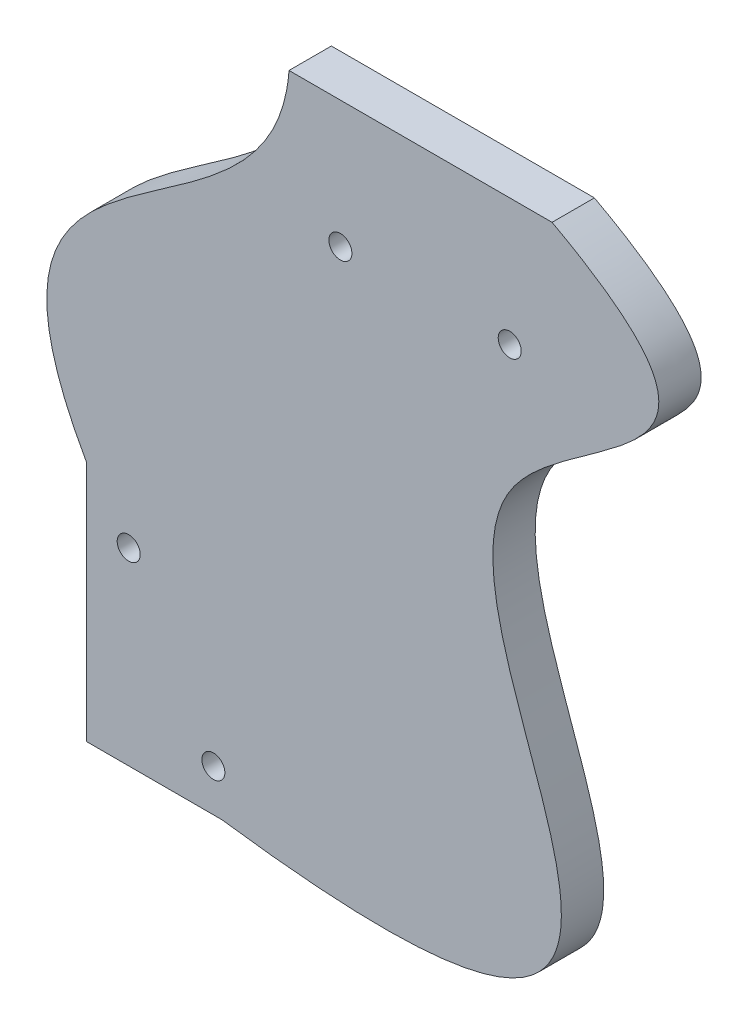
ISO-10303-21;
HEADER;
FILE_DESCRIPTION(('STEP AP214'),'2;1');
FILE_NAME('part.step','',(''),(''),'','','');
FILE_SCHEMA(('AUTOMOTIVE_DESIGN { 1 0 10303 214 1 1 1 1 }'));
ENDSEC;
DATA;
#1=APPLICATION_CONTEXT('core data for automotive mechanical design processes');
#2=APPLICATION_PROTOCOL_DEFINITION('international standard','automotive_design',2000,#1);
#3=PRODUCT_CONTEXT('',#1,'mechanical');
#4=PRODUCT('Part','Part','',(#3));
#5=PRODUCT_RELATED_PRODUCT_CATEGORY('part','',(#4));
#6=PRODUCT_DEFINITION_FORMATION('','',#4);
#7=PRODUCT_DEFINITION_CONTEXT('part definition',#1,'design');
#8=PRODUCT_DEFINITION('design','',#6,#7);
#9=PRODUCT_DEFINITION_SHAPE('','',#8);
#10=(LENGTH_UNIT() NAMED_UNIT(*) SI_UNIT(.MILLI.,.METRE.));
#11=(NAMED_UNIT(*) PLANE_ANGLE_UNIT() SI_UNIT($,.RADIAN.));
#12=(NAMED_UNIT(*) SI_UNIT($,.STERADIAN.) SOLID_ANGLE_UNIT());
#13=UNCERTAINTY_MEASURE_WITH_UNIT(LENGTH_MEASURE(1.E-05),#10,'distance_accuracy_value','');
#14=(GEOMETRIC_REPRESENTATION_CONTEXT(3) GLOBAL_UNCERTAINTY_ASSIGNED_CONTEXT((#13)) GLOBAL_UNIT_ASSIGNED_CONTEXT((#10,
#11,#12)) REPRESENTATION_CONTEXT('',''));
#15=CARTESIAN_POINT('',(0.,0.,0.));
#16=DIRECTION('',(0.,0.,1.));
#17=DIRECTION('',(1.,0.,0.));
#18=AXIS2_PLACEMENT_3D('',#15,#16,#17);
#19=CARTESIAN_POINT('',(0.,-66.04,6.35));
#20=DIRECTION('',(1.,0.,0.));
#21=DIRECTION('',(0.,1.,0.));
#22=AXIS2_PLACEMENT_3D('',#19,#20,#21);
#23=PLANE('',#22);
#24=DIRECTION('',(0.,-1.,0.));
#25=VECTOR('',#24,1.);
#26=CARTESIAN_POINT('',(0.,-66.04,0.));
#27=LINE('',#26,#25);
#28=CARTESIAN_POINT('',(0.,-66.04,0.));
#29=VERTEX_POINT('',#28);
#30=CARTESIAN_POINT('',(0.,-102.362,0.));
#31=VERTEX_POINT('',#30);
#32=EDGE_CURVE('E127',#29,#31,#27,.T.);
#33=ORIENTED_EDGE('',*,*,#32,.T.);
#34=DIRECTION('',(0.,0.,-1.));
#35=VECTOR('',#34,1.);
#36=CARTESIAN_POINT('',(0.,-102.362,6.35));
#37=LINE('',#36,#35);
#38=CARTESIAN_POINT('',(0.,-102.362,6.35));
#39=VERTEX_POINT('',#38);
#40=EDGE_CURVE('E11',#39,#31,#37,.T.);
#41=ORIENTED_EDGE('',*,*,#40,.F.);
#42=DIRECTION('',(0.,-1.,0.));
#43=VECTOR('',#42,1.);
#44=CARTESIAN_POINT('',(0.,-66.04,6.35));
#45=LINE('',#44,#43);
#46=CARTESIAN_POINT('',(0.,-66.04,6.35));
#47=VERTEX_POINT('',#46);
#48=EDGE_CURVE('E170',#47,#39,#45,.T.);
#49=ORIENTED_EDGE('',*,*,#48,.F.);
#50=DIRECTION('',(0.,0.,-1.));
#51=VECTOR('',#50,1.);
#52=CARTESIAN_POINT('',(0.,-66.04,6.35));
#53=LINE('',#52,#51);
#54=EDGE_CURVE('E57',#47,#29,#53,.T.);
#55=ORIENTED_EDGE('',*,*,#54,.T.);
#56=EDGE_LOOP('',(#33,#41,#49,#55));
#57=FACE_BOUND('',#56,.T.);
#58=ADVANCED_FACE('F40',(#57),#23,.F.);
#59=CARTESIAN_POINT('',(0.,-102.362,6.35));
#60=DIRECTION('',(0.,1.,0.));
#61=DIRECTION('',(0.,0.,1.));
#62=AXIS2_PLACEMENT_3D('',#59,#60,#61);
#63=PLANE('',#62);
#64=DIRECTION('',(1.,0.,0.));
#65=VECTOR('',#64,1.);
#66=CARTESIAN_POINT('',(0.,-102.362,0.));
#67=LINE('',#66,#65);
#68=CARTESIAN_POINT('',(20.32,-102.362,0.));
#69=VERTEX_POINT('',#68);
#70=EDGE_CURVE('E147',#31,#69,#67,.T.);
#71=ORIENTED_EDGE('',*,*,#70,.T.);
#72=DIRECTION('',(0.,0.,-1.));
#73=VECTOR('',#72,1.);
#74=CARTESIAN_POINT('',(20.32,-102.362,6.35));
#75=LINE('',#74,#73);
#76=CARTESIAN_POINT('',(20.32,-102.362,6.35));
#77=VERTEX_POINT('',#76);
#78=EDGE_CURVE('E49',#77,#69,#75,.T.);
#79=ORIENTED_EDGE('',*,*,#78,.F.);
#80=DIRECTION('',(1.,0.,0.));
#81=VECTOR('',#80,1.);
#82=CARTESIAN_POINT('',(0.,-102.362,6.35));
#83=LINE('',#82,#81);
#84=EDGE_CURVE('E86',#39,#77,#83,.T.);
#85=ORIENTED_EDGE('',*,*,#84,.F.);
#86=ORIENTED_EDGE('',*,*,#40,.T.);
#87=EDGE_LOOP('',(#71,#79,#85,#86));
#88=FACE_BOUND('',#87,.T.);
#89=ADVANCED_FACE('F142',(#88),#63,.F.);
#90=CARTESIAN_POINT('',(20.32,-102.362,6.35));
#91=CARTESIAN_POINT('',(112.724526082382,-115.037668853841,6.35));
#92=CARTESIAN_POINT('',(12.1368975455014,-33.9929014578583,6.35));
#93=CARTESIAN_POINT('',(105.278452179433,-19.0757059776361,6.35));
#94=CARTESIAN_POINT('',(69.85,0.,6.35));
#95=B_SPLINE_CURVE_WITH_KNOTS('',3,(#90,#91,#92,#93,#94),.UNSPECIFIED.,.F.,.F.,(4,1,4),(0.,
0.643707461783056,1.),.UNSPECIFIED.);
#96=DIRECTION('',(0.,0.,-1.));
#97=VECTOR('',#96,1.);
#98=SURFACE_OF_LINEAR_EXTRUSION('',#95,#97);
#99=CARTESIAN_POINT('',(20.32,-102.362,0.));
#100=CARTESIAN_POINT('',(112.724526082382,-115.037668853841,0.));
#101=CARTESIAN_POINT('',(12.1368975455014,-33.9929014578583,0.));
#102=CARTESIAN_POINT('',(105.278452179433,-19.0757059776361,0.));
#103=CARTESIAN_POINT('',(69.85,0.,0.));
#104=B_SPLINE_CURVE_WITH_KNOTS('',3,(#99,#100,#101,#102,#103),.UNSPECIFIED.,.F.,.F.,(4,1,4),(0.,
0.643707461783056,1.),.UNSPECIFIED.);
#105=CARTESIAN_POINT('',(69.85,0.,0.));
#106=VERTEX_POINT('',#105);
#107=EDGE_CURVE('E107',#69,#106,#104,.T.);
#108=ORIENTED_EDGE('',*,*,#107,.T.);
#109=DIRECTION('',(0.,0.,-1.));
#110=VECTOR('',#109,1.);
#111=CARTESIAN_POINT('',(69.85,0.,6.35));
#112=LINE('',#111,#110);
#113=CARTESIAN_POINT('',(69.85,0.,6.35));
#114=VERTEX_POINT('',#113);
#115=EDGE_CURVE('E104',#114,#106,#112,.T.);
#116=ORIENTED_EDGE('',*,*,#115,.F.);
#117=EDGE_CURVE('E93',#77,#114,#95,.T.);
#118=ORIENTED_EDGE('',*,*,#117,.F.);
#119=ORIENTED_EDGE('',*,*,#78,.T.);
#120=EDGE_LOOP('',(#108,#116,#118,#119));
#121=FACE_BOUND('',#120,.T.);
#122=ADVANCED_FACE('F105',(#121),#98,.F.);
#123=CARTESIAN_POINT('',(30.3957830429292,0.,6.35));
#124=DIRECTION('',(0.,1.,0.));
#125=DIRECTION('',(0.,0.,1.));
#126=AXIS2_PLACEMENT_3D('',#123,#124,#125);
#127=PLANE('',#126);
#128=DIRECTION('',(1.,0.,0.));
#129=VECTOR('',#128,1.);
#130=CARTESIAN_POINT('',(30.3957830429292,0.,0.));
#131=LINE('',#130,#129);
#132=CARTESIAN_POINT('',(30.3957830429292,0.,0.));
#133=VERTEX_POINT('',#132);
#134=EDGE_CURVE('E153',#133,#106,#131,.T.);
#135=ORIENTED_EDGE('',*,*,#134,.F.);
#136=DIRECTION('',(0.,0.,-1.));
#137=VECTOR('',#136,1.);
#138=CARTESIAN_POINT('',(30.3957830429292,0.,6.35));
#139=LINE('',#138,#137);
#140=CARTESIAN_POINT('',(30.3957830429292,0.,6.35));
#141=VERTEX_POINT('',#140);
#142=EDGE_CURVE('E74',#141,#133,#139,.T.);
#143=ORIENTED_EDGE('',*,*,#142,.F.);
#144=DIRECTION('',(1.,0.,0.));
#145=VECTOR('',#144,1.);
#146=CARTESIAN_POINT('',(30.3957830429292,0.,6.35));
#147=LINE('',#146,#145);
#148=EDGE_CURVE('E98',#141,#114,#147,.T.);
#149=ORIENTED_EDGE('',*,*,#148,.T.);
#150=ORIENTED_EDGE('',*,*,#115,.T.);
#151=EDGE_LOOP('',(#135,#143,#149,#150));
#152=FACE_BOUND('',#151,.T.);
#153=ADVANCED_FACE('F112',(#152),#127,.T.);
#154=CARTESIAN_POINT('',(0.,-66.04,6.35));
#155=CARTESIAN_POINT('',(-23.0224458598111,-25.4597939029748,6.35));
#156=CARTESIAN_POINT('',(28.2122048217004,-29.6988341112375,6.35));
#157=CARTESIAN_POINT('',(30.3957830429292,0.,6.35));
#158=B_SPLINE_CURVE_WITH_KNOTS('',3,(#154,#155,#156,#157),.UNSPECIFIED.,.F.,.F.,(4,4),(0.,1.),.UNSPECIFIED.);
#159=DIRECTION('',(0.,0.,-1.));
#160=VECTOR('',#159,1.);
#161=SURFACE_OF_LINEAR_EXTRUSION('',#158,#160);
#162=CARTESIAN_POINT('',(0.,-66.04,0.));
#163=CARTESIAN_POINT('',(-23.0224458598111,-25.4597939029748,0.));
#164=CARTESIAN_POINT('',(28.2122048217004,-29.6988341112375,0.));
#165=CARTESIAN_POINT('',(30.3957830429292,0.,0.));
#166=B_SPLINE_CURVE_WITH_KNOTS('',3,(#162,#163,#164,#165),.UNSPECIFIED.,.F.,.F.,(4,4),(0.,1.),.UNSPECIFIED.);
#167=EDGE_CURVE('E158',#29,#133,#166,.T.);
#168=ORIENTED_EDGE('',*,*,#167,.F.);
#169=ORIENTED_EDGE('',*,*,#54,.F.);
#170=EDGE_CURVE('E114',#47,#141,#158,.T.);
#171=ORIENTED_EDGE('',*,*,#170,.T.);
#172=ORIENTED_EDGE('',*,*,#142,.T.);
#173=EDGE_LOOP('',(#168,#169,#171,#172));
#174=FACE_BOUND('',#173,.T.);
#175=ADVANCED_FACE('F133',(#174),#161,.T.);
#176=CARTESIAN_POINT('',(62.4632691578035,-57.7592746158494,6.35));
#177=DIRECTION('',(0.,0.,-1.));
#178=DIRECTION('',(-1.,0.,0.));
#179=AXIS2_PLACEMENT_3D('',#176,#177,#178);
#180=PLANE('',#179);
#181=CARTESIAN_POINT('',(63.5,-19.05,6.35));
#182=DIRECTION('',(0.,0.,-1.));
#183=DIRECTION('',(0.,1.,0.));
#184=AXIS2_PLACEMENT_3D('',#181,#182,#183);
#185=CIRCLE('',#184,1.72719999999998);
#186=CARTESIAN_POINT('',(63.5,-17.3228,6.35));
#187=VERTEX_POINT('',#186);
#188=EDGE_CURVE('E213',#187,#187,#185,.T.);
#189=ORIENTED_EDGE('',*,*,#188,.T.);
#190=EDGE_LOOP('',(#189));
#191=FACE_BOUND('',#190,.T.);
#192=CARTESIAN_POINT('',(38.1,-19.05,6.35));
#193=DIRECTION('',(0.,0.,-1.));
#194=DIRECTION('',(0.,1.,0.));
#195=AXIS2_PLACEMENT_3D('',#192,#193,#194);
#196=CIRCLE('',#195,1.72719999999999);
#197=CARTESIAN_POINT('',(38.1,-17.3228,6.35));
#198=VERTEX_POINT('',#197);
#199=EDGE_CURVE('E205',#198,#198,#196,.T.);
#200=ORIENTED_EDGE('',*,*,#199,.T.);
#201=EDGE_LOOP('',(#200));
#202=FACE_BOUND('',#201,.T.);
#203=CARTESIAN_POINT('',(6.35,-74.041,6.35));
#204=DIRECTION('',(0.,0.,-1.));
#205=DIRECTION('',(0.,1.,0.));
#206=AXIS2_PLACEMENT_3D('',#203,#204,#205);
#207=CIRCLE('',#206,1.72719999999999);
#208=CARTESIAN_POINT('',(6.35,-72.3138,6.35));
#209=VERTEX_POINT('',#208);
#210=EDGE_CURVE('E197',#209,#209,#207,.T.);
#211=ORIENTED_EDGE('',*,*,#210,.T.);
#212=EDGE_LOOP('',(#211));
#213=FACE_BOUND('',#212,.T.);
#214=CARTESIAN_POINT('',(19.05,-96.0374,6.35));
#215=DIRECTION('',(0.,0.,-1.));
#216=DIRECTION('',(0.,1.,0.));
#217=AXIS2_PLACEMENT_3D('',#214,#215,#216);
#218=CIRCLE('',#217,1.72719999999999);
#219=CARTESIAN_POINT('',(19.05,-94.3102,6.35));
#220=VERTEX_POINT('',#219);
#221=EDGE_CURVE('E189',#220,#220,#218,.T.);
#222=ORIENTED_EDGE('',*,*,#221,.T.);
#223=EDGE_LOOP('',(#222));
#224=FACE_BOUND('',#223,.T.);
#225=ORIENTED_EDGE('',*,*,#48,.T.);
#226=ORIENTED_EDGE('',*,*,#84,.T.);
#227=ORIENTED_EDGE('',*,*,#117,.T.);
#228=ORIENTED_EDGE('',*,*,#148,.F.);
#229=ORIENTED_EDGE('',*,*,#170,.F.);
#230=EDGE_LOOP('',(#225,#226,#227,#228,#229));
#231=FACE_BOUND('',#230,.T.);
#232=ADVANCED_FACE('F95',(#191,#202,#213,#224,#231),#180,.F.);
#233=CARTESIAN_POINT('',(62.4632691578035,-57.7592746158494,0.));
#234=DIRECTION('',(0.,0.,-1.));
#235=DIRECTION('',(-1.,0.,0.));
#236=AXIS2_PLACEMENT_3D('',#233,#234,#235);
#237=PLANE('',#236);
#238=CARTESIAN_POINT('',(63.5,-19.05,0.));
#239=DIRECTION('',(0.,0.,-1.));
#240=DIRECTION('',(0.,1.,0.));
#241=AXIS2_PLACEMENT_3D('',#238,#239,#240);
#242=CIRCLE('',#241,1.72719999999998);
#243=CARTESIAN_POINT('',(63.5,-17.3228,0.));
#244=VERTEX_POINT('',#243);
#245=EDGE_CURVE('E217',#244,#244,#242,.T.);
#246=ORIENTED_EDGE('',*,*,#245,.F.);
#247=EDGE_LOOP('',(#246));
#248=FACE_BOUND('',#247,.T.);
#249=CARTESIAN_POINT('',(38.1,-19.05,0.));
#250=DIRECTION('',(0.,0.,-1.));
#251=DIRECTION('',(0.,1.,0.));
#252=AXIS2_PLACEMENT_3D('',#249,#250,#251);
#253=CIRCLE('',#252,1.72719999999999);
#254=CARTESIAN_POINT('',(38.1,-17.3228,0.));
#255=VERTEX_POINT('',#254);
#256=EDGE_CURVE('E209',#255,#255,#253,.T.);
#257=ORIENTED_EDGE('',*,*,#256,.F.);
#258=EDGE_LOOP('',(#257));
#259=FACE_BOUND('',#258,.T.);
#260=CARTESIAN_POINT('',(6.35,-74.041,0.));
#261=DIRECTION('',(0.,0.,-1.));
#262=DIRECTION('',(0.,1.,0.));
#263=AXIS2_PLACEMENT_3D('',#260,#261,#262);
#264=CIRCLE('',#263,1.72719999999999);
#265=CARTESIAN_POINT('',(6.35,-72.3138,0.));
#266=VERTEX_POINT('',#265);
#267=EDGE_CURVE('E201',#266,#266,#264,.T.);
#268=ORIENTED_EDGE('',*,*,#267,.F.);
#269=EDGE_LOOP('',(#268));
#270=FACE_BOUND('',#269,.T.);
#271=CARTESIAN_POINT('',(19.05,-96.0374,0.));
#272=DIRECTION('',(0.,0.,-1.));
#273=DIRECTION('',(0.,1.,0.));
#274=AXIS2_PLACEMENT_3D('',#271,#272,#273);
#275=CIRCLE('',#274,1.72719999999999);
#276=CARTESIAN_POINT('',(19.05,-94.3102,0.));
#277=VERTEX_POINT('',#276);
#278=EDGE_CURVE('E193',#277,#277,#275,.T.);
#279=ORIENTED_EDGE('',*,*,#278,.F.);
#280=EDGE_LOOP('',(#279));
#281=FACE_BOUND('',#280,.T.);
#282=ORIENTED_EDGE('',*,*,#32,.F.);
#283=ORIENTED_EDGE('',*,*,#167,.T.);
#284=ORIENTED_EDGE('',*,*,#134,.T.);
#285=ORIENTED_EDGE('',*,*,#107,.F.);
#286=ORIENTED_EDGE('',*,*,#70,.F.);
#287=EDGE_LOOP('',(#282,#283,#284,#285,#286));
#288=FACE_BOUND('',#287,.T.);
#289=ADVANCED_FACE('F137',(#248,#259,#270,#281,#288),#237,.T.);
#290=CARTESIAN_POINT('',(19.05,-96.0374,0.));
#291=DIRECTION('',(0.,0.,-1.));
#292=DIRECTION('',(0.,1.,0.));
#293=AXIS2_PLACEMENT_3D('',#290,#291,#292);
#294=CYLINDRICAL_SURFACE('',#293,1.72719999999999);
#295=ORIENTED_EDGE('',*,*,#221,.F.);
#296=EDGE_LOOP('',(#295));
#297=FACE_BOUND('',#296,.T.);
#298=ORIENTED_EDGE('',*,*,#278,.T.);
#299=EDGE_LOOP('',(#298));
#300=FACE_BOUND('',#299,.T.);
#301=ADVANCED_FACE('F227',(#297,#300),#294,.F.);
#302=CARTESIAN_POINT('',(6.35,-74.041,0.));
#303=DIRECTION('',(0.,0.,-1.));
#304=DIRECTION('',(0.,1.,0.));
#305=AXIS2_PLACEMENT_3D('',#302,#303,#304);
#306=CYLINDRICAL_SURFACE('',#305,1.72719999999999);
#307=ORIENTED_EDGE('',*,*,#210,.F.);
#308=EDGE_LOOP('',(#307));
#309=FACE_BOUND('',#308,.T.);
#310=ORIENTED_EDGE('',*,*,#267,.T.);
#311=EDGE_LOOP('',(#310));
#312=FACE_BOUND('',#311,.T.);
#313=ADVANCED_FACE('F235',(#309,#312),#306,.F.);
#314=CARTESIAN_POINT('',(38.1,-19.05,0.));
#315=DIRECTION('',(0.,0.,-1.));
#316=DIRECTION('',(0.,1.,0.));
#317=AXIS2_PLACEMENT_3D('',#314,#315,#316);
#318=CYLINDRICAL_SURFACE('',#317,1.72719999999999);
#319=ORIENTED_EDGE('',*,*,#199,.F.);
#320=EDGE_LOOP('',(#319));
#321=FACE_BOUND('',#320,.T.);
#322=ORIENTED_EDGE('',*,*,#256,.T.);
#323=EDGE_LOOP('',(#322));
#324=FACE_BOUND('',#323,.T.);
#325=ADVANCED_FACE('F241',(#321,#324),#318,.F.);
#326=CARTESIAN_POINT('',(63.5,-19.05,0.));
#327=DIRECTION('',(0.,0.,-1.));
#328=DIRECTION('',(0.,1.,0.));
#329=AXIS2_PLACEMENT_3D('',#326,#327,#328);
#330=CYLINDRICAL_SURFACE('',#329,1.72719999999998);
#331=ORIENTED_EDGE('',*,*,#188,.F.);
#332=EDGE_LOOP('',(#331));
#333=FACE_BOUND('',#332,.T.);
#334=ORIENTED_EDGE('',*,*,#245,.T.);
#335=EDGE_LOOP('',(#334));
#336=FACE_BOUND('',#335,.T.);
#337=ADVANCED_FACE('F223',(#333,#336),#330,.F.);
#338=CLOSED_SHELL('',(#58,#89,#122,#153,#175,#232,#289,#301,#313,#325,#337));
#339=MANIFOLD_SOLID_BREP('B2',#338);
#340=ADVANCED_BREP_SHAPE_REPRESENTATION('',(#18,#339),#14);
#341=SHAPE_DEFINITION_REPRESENTATION(#9,#340);
ENDSEC;
END-ISO-10303-21;
